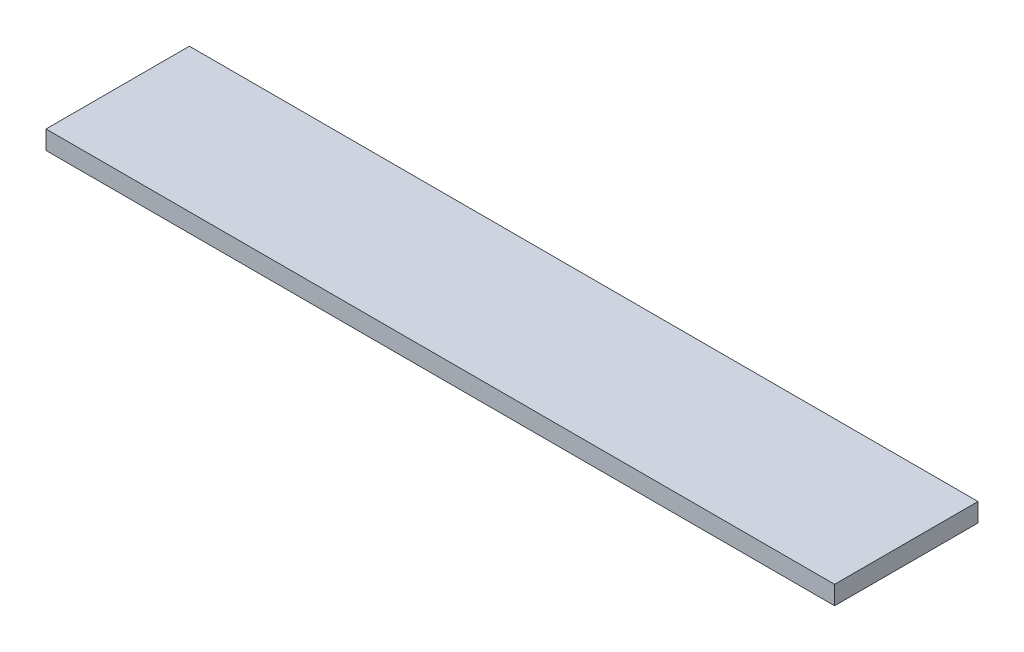
ISO-10303-21;
HEADER;
FILE_DESCRIPTION(('STEP AP214'),'2;1');
FILE_NAME('part.step','',(''),(''),'','','');
FILE_SCHEMA(('AUTOMOTIVE_DESIGN { 1 0 10303 214 1 1 1 1 }'));
ENDSEC;
DATA;
#1=APPLICATION_CONTEXT('core data for automotive mechanical design processes');
#2=APPLICATION_PROTOCOL_DEFINITION('international standard','automotive_design',2000,#1);
#3=PRODUCT_CONTEXT('',#1,'mechanical');
#4=PRODUCT('Part','Part','',(#3));
#5=PRODUCT_RELATED_PRODUCT_CATEGORY('part','',(#4));
#6=PRODUCT_DEFINITION_FORMATION('','',#4);
#7=PRODUCT_DEFINITION_CONTEXT('part definition',#1,'design');
#8=PRODUCT_DEFINITION('design','',#6,#7);
#9=PRODUCT_DEFINITION_SHAPE('','',#8);
#10=(LENGTH_UNIT() NAMED_UNIT(*) SI_UNIT(.MILLI.,.METRE.));
#11=(NAMED_UNIT(*) PLANE_ANGLE_UNIT() SI_UNIT($,.RADIAN.));
#12=(NAMED_UNIT(*) SI_UNIT($,.STERADIAN.) SOLID_ANGLE_UNIT());
#13=UNCERTAINTY_MEASURE_WITH_UNIT(LENGTH_MEASURE(1.E-05),#10,'distance_accuracy_value','');
#14=(GEOMETRIC_REPRESENTATION_CONTEXT(3) GLOBAL_UNCERTAINTY_ASSIGNED_CONTEXT((#13)) GLOBAL_UNIT_ASSIGNED_CONTEXT((#10,
#11,#12)) REPRESENTATION_CONTEXT('',''));
#15=CARTESIAN_POINT('',(0.,0.,0.));
#16=DIRECTION('',(0.,0.,1.));
#17=DIRECTION('',(1.,0.,0.));
#18=AXIS2_PLACEMENT_3D('',#15,#16,#17);
#19=CARTESIAN_POINT('',(34.925,1.651,6.35));
#20=DIRECTION('',(-1.,0.,0.));
#21=DIRECTION('',(0.,0.,1.));
#22=AXIS2_PLACEMENT_3D('',#19,#20,#21);
#23=PLANE('',#22);
#24=DIRECTION('',(0.,0.,-1.));
#25=VECTOR('',#24,1.);
#26=CARTESIAN_POINT('',(34.925,0.,6.35));
#27=LINE('',#26,#25);
#28=CARTESIAN_POINT('',(34.925,0.,6.35));
#29=VERTEX_POINT('',#28);
#30=CARTESIAN_POINT('',(34.925,0.,-6.35));
#31=VERTEX_POINT('',#30);
#32=EDGE_CURVE('E100',#29,#31,#27,.T.);
#33=ORIENTED_EDGE('',*,*,#32,.T.);
#34=DIRECTION('',(0.,-1.,0.));
#35=VECTOR('',#34,1.);
#36=CARTESIAN_POINT('',(34.925,1.651,-6.35));
#37=LINE('',#36,#35);
#38=CARTESIAN_POINT('',(34.925,1.651,-6.35));
#39=VERTEX_POINT('',#38);
#40=EDGE_CURVE('E11',#39,#31,#37,.T.);
#41=ORIENTED_EDGE('',*,*,#40,.F.);
#42=DIRECTION('',(0.,0.,-1.));
#43=VECTOR('',#42,1.);
#44=CARTESIAN_POINT('',(34.925,1.651,6.35));
#45=LINE('',#44,#43);
#46=CARTESIAN_POINT('',(34.925,1.651,6.35));
#47=VERTEX_POINT('',#46);
#48=EDGE_CURVE('E88',#47,#39,#45,.T.);
#49=ORIENTED_EDGE('',*,*,#48,.F.);
#50=DIRECTION('',(0.,-1.,0.));
#51=VECTOR('',#50,1.);
#52=CARTESIAN_POINT('',(34.925,1.651,6.35));
#53=LINE('',#52,#51);
#54=EDGE_CURVE('E96',#47,#29,#53,.T.);
#55=ORIENTED_EDGE('',*,*,#54,.T.);
#56=EDGE_LOOP('',(#33,#41,#49,#55));
#57=FACE_BOUND('',#56,.T.);
#58=ADVANCED_FACE('F37',(#57),#23,.F.);
#59=CARTESIAN_POINT('',(-34.925,1.651,-6.35));
#60=DIRECTION('',(0.,0.,1.));
#61=DIRECTION('',(1.,0.,0.));
#62=AXIS2_PLACEMENT_3D('',#59,#60,#61);
#63=PLANE('',#62);
#64=DIRECTION('',(-1.,0.,0.));
#65=VECTOR('',#64,1.);
#66=CARTESIAN_POINT('',(-34.925,0.,-6.35));
#67=LINE('',#66,#65);
#68=CARTESIAN_POINT('',(-34.925,0.,-6.35));
#69=VERTEX_POINT('',#68);
#70=EDGE_CURVE('E92',#31,#69,#67,.T.);
#71=ORIENTED_EDGE('',*,*,#70,.T.);
#72=DIRECTION('',(0.,-1.,0.));
#73=VECTOR('',#72,1.);
#74=CARTESIAN_POINT('',(-34.925,1.651,-6.35));
#75=LINE('',#74,#73);
#76=CARTESIAN_POINT('',(-34.925,1.651,-6.35));
#77=VERTEX_POINT('',#76);
#78=EDGE_CURVE('E45',#77,#69,#75,.T.);
#79=ORIENTED_EDGE('',*,*,#78,.F.);
#80=DIRECTION('',(-1.,0.,0.));
#81=VECTOR('',#80,1.);
#82=CARTESIAN_POINT('',(-34.925,1.651,-6.35));
#83=LINE('',#82,#81);
#84=EDGE_CURVE('E83',#39,#77,#83,.T.);
#85=ORIENTED_EDGE('',*,*,#84,.F.);
#86=ORIENTED_EDGE('',*,*,#40,.T.);
#87=EDGE_LOOP('',(#71,#79,#85,#86));
#88=FACE_BOUND('',#87,.T.);
#89=ADVANCED_FACE('F91',(#88),#63,.F.);
#90=CARTESIAN_POINT('',(-34.925,1.651,6.35));
#91=DIRECTION('',(1.,0.,0.));
#92=DIRECTION('',(0.,0.,-1.));
#93=AXIS2_PLACEMENT_3D('',#90,#91,#92);
#94=PLANE('',#93);
#95=DIRECTION('',(0.,0.,1.));
#96=VECTOR('',#95,1.);
#97=CARTESIAN_POINT('',(-34.925,0.,6.35));
#98=LINE('',#97,#96);
#99=CARTESIAN_POINT('',(-34.925,0.,6.35));
#100=VERTEX_POINT('',#99);
#101=EDGE_CURVE('E70',#69,#100,#98,.T.);
#102=ORIENTED_EDGE('',*,*,#101,.T.);
#103=DIRECTION('',(0.,-1.,0.));
#104=VECTOR('',#103,1.);
#105=CARTESIAN_POINT('',(-34.925,1.651,6.35));
#106=LINE('',#105,#104);
#107=CARTESIAN_POINT('',(-34.925,1.651,6.35));
#108=VERTEX_POINT('',#107);
#109=EDGE_CURVE('E93',#108,#100,#106,.T.);
#110=ORIENTED_EDGE('',*,*,#109,.F.);
#111=DIRECTION('',(0.,0.,1.));
#112=VECTOR('',#111,1.);
#113=CARTESIAN_POINT('',(-34.925,1.651,6.35));
#114=LINE('',#113,#112);
#115=EDGE_CURVE('E86',#77,#108,#114,.T.);
#116=ORIENTED_EDGE('',*,*,#115,.F.);
#117=ORIENTED_EDGE('',*,*,#78,.T.);
#118=EDGE_LOOP('',(#102,#110,#116,#117));
#119=FACE_BOUND('',#118,.T.);
#120=ADVANCED_FACE('F94',(#119),#94,.F.);
#121=CARTESIAN_POINT('',(-34.925,1.651,6.35));
#122=DIRECTION('',(0.,0.,-1.));
#123=DIRECTION('',(-1.,0.,0.));
#124=AXIS2_PLACEMENT_3D('',#121,#122,#123);
#125=PLANE('',#124);
#126=DIRECTION('',(1.,0.,0.));
#127=VECTOR('',#126,1.);
#128=CARTESIAN_POINT('',(-34.925,0.,6.35));
#129=LINE('',#128,#127);
#130=EDGE_CURVE('E76',#100,#29,#129,.T.);
#131=ORIENTED_EDGE('',*,*,#130,.T.);
#132=ORIENTED_EDGE('',*,*,#54,.F.);
#133=DIRECTION('',(1.,0.,0.));
#134=VECTOR('',#133,1.);
#135=CARTESIAN_POINT('',(-34.925,1.651,6.35));
#136=LINE('',#135,#134);
#137=EDGE_CURVE('E53',#108,#47,#136,.T.);
#138=ORIENTED_EDGE('',*,*,#137,.F.);
#139=ORIENTED_EDGE('',*,*,#109,.T.);
#140=EDGE_LOOP('',(#131,#132,#138,#139));
#141=FACE_BOUND('',#140,.T.);
#142=ADVANCED_FACE('F107',(#141),#125,.F.);
#143=CARTESIAN_POINT('',(0.,1.651,0.));
#144=DIRECTION('',(0.,-1.,0.));
#145=DIRECTION('',(0.,0.,-1.));
#146=AXIS2_PLACEMENT_3D('',#143,#144,#145);
#147=PLANE('',#146);
#148=ORIENTED_EDGE('',*,*,#48,.T.);
#149=ORIENTED_EDGE('',*,*,#84,.T.);
#150=ORIENTED_EDGE('',*,*,#115,.T.);
#151=ORIENTED_EDGE('',*,*,#137,.T.);
#152=EDGE_LOOP('',(#148,#149,#150,#151));
#153=FACE_BOUND('',#152,.T.);
#154=ADVANCED_FACE('F84',(#153),#147,.F.);
#155=CARTESIAN_POINT('',(0.,0.,0.));
#156=DIRECTION('',(0.,-1.,0.));
#157=DIRECTION('',(0.,0.,-1.));
#158=AXIS2_PLACEMENT_3D('',#155,#156,#157);
#159=PLANE('',#158);
#160=ORIENTED_EDGE('',*,*,#32,.F.);
#161=ORIENTED_EDGE('',*,*,#130,.F.);
#162=ORIENTED_EDGE('',*,*,#101,.F.);
#163=ORIENTED_EDGE('',*,*,#70,.F.);
#164=EDGE_LOOP('',(#160,#161,#162,#163));
#165=FACE_BOUND('',#164,.T.);
#166=ADVANCED_FACE('F110',(#165),#159,.T.);
#167=CLOSED_SHELL('',(#58,#89,#120,#142,#154,#166));
#168=MANIFOLD_SOLID_BREP('B2',#167);
#169=ADVANCED_BREP_SHAPE_REPRESENTATION('',(#18,#168),#14);
#170=SHAPE_DEFINITION_REPRESENTATION(#9,#169);
ENDSEC;
END-ISO-10303-21;
